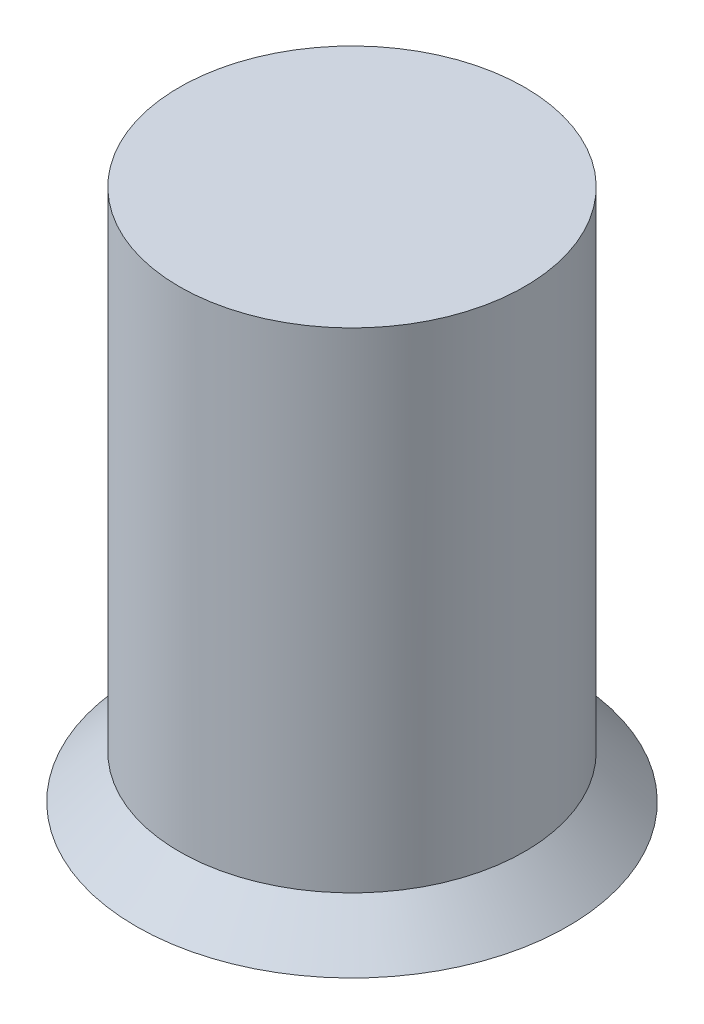
ISO-10303-21;
HEADER;
FILE_DESCRIPTION(('STEP AP214'),'2;1');
FILE_NAME('part.step','',(''),(''),'','','');
FILE_SCHEMA(('AUTOMOTIVE_DESIGN { 1 0 10303 214 1 1 1 1 }'));
ENDSEC;
DATA;
#1=APPLICATION_CONTEXT('core data for automotive mechanical design processes');
#2=APPLICATION_PROTOCOL_DEFINITION('international standard','automotive_design',2000,#1);
#3=PRODUCT_CONTEXT('',#1,'mechanical');
#4=PRODUCT('Part','Part','',(#3));
#5=PRODUCT_RELATED_PRODUCT_CATEGORY('part','',(#4));
#6=PRODUCT_DEFINITION_FORMATION('','',#4);
#7=PRODUCT_DEFINITION_CONTEXT('part definition',#1,'design');
#8=PRODUCT_DEFINITION('design','',#6,#7);
#9=PRODUCT_DEFINITION_SHAPE('','',#8);
#10=(LENGTH_UNIT() NAMED_UNIT(*) SI_UNIT(.MILLI.,.METRE.));
#11=(NAMED_UNIT(*) PLANE_ANGLE_UNIT() SI_UNIT($,.RADIAN.));
#12=(NAMED_UNIT(*) SI_UNIT($,.STERADIAN.) SOLID_ANGLE_UNIT());
#13=UNCERTAINTY_MEASURE_WITH_UNIT(LENGTH_MEASURE(1.E-05),#10,'distance_accuracy_value','');
#14=(GEOMETRIC_REPRESENTATION_CONTEXT(3) GLOBAL_UNCERTAINTY_ASSIGNED_CONTEXT((#13)) GLOBAL_UNIT_ASSIGNED_CONTEXT((#10,
#11,#12)) REPRESENTATION_CONTEXT('',''));
#15=CARTESIAN_POINT('',(0.,0.,0.));
#16=DIRECTION('',(0.,0.,1.));
#17=DIRECTION('',(1.,0.,0.));
#18=AXIS2_PLACEMENT_3D('',#15,#16,#17);
#19=CARTESIAN_POINT('',(0.,0.,0.));
#20=DIRECTION('',(0.,1.,0.));
#21=DIRECTION('',(0.,0.,1.));
#22=AXIS2_PLACEMENT_3D('',#19,#20,#21);
#23=PLANE('',#22);
#24=CARTESIAN_POINT('',(0.,0.,0.));
#25=DIRECTION('',(0.,1.,0.));
#26=DIRECTION('',(0.,0.,1.));
#27=AXIS2_PLACEMENT_3D('',#24,#25,#26);
#28=CIRCLE('',#27,15.);
#29=CARTESIAN_POINT('',(0.,0.,-15.));
#30=VERTEX_POINT('',#29);
#31=EDGE_CURVE('E38',#30,#30,#28,.T.);
#32=ORIENTED_EDGE('',*,*,#31,.F.);
#33=EDGE_LOOP('',(#32));
#34=FACE_BOUND('',#33,.T.);
#35=ADVANCED_FACE('F31',(#34),#23,.F.);
#36=CARTESIAN_POINT('',(0.,3.,0.));
#37=DIRECTION('',(0.,-1.,0.));
#38=DIRECTION('',(0.,0.,-1.));
#39=AXIS2_PLACEMENT_3D('',#36,#37,#38);
#40=CONICAL_SURFACE('',#39,12.,0.785398163397448);
#41=CARTESIAN_POINT('',(0.,3.,0.));
#42=DIRECTION('',(0.,1.,0.));
#43=DIRECTION('',(0.,0.,1.));
#44=AXIS2_PLACEMENT_3D('',#41,#42,#43);
#45=CIRCLE('',#44,12.);
#46=CARTESIAN_POINT('',(0.,3.,-12.));
#47=VERTEX_POINT('',#46);
#48=EDGE_CURVE('E10',#47,#47,#45,.T.);
#49=CARTESIAN_POINT('',(0.,0.,-15.));
#50=CARTESIAN_POINT('',(0.,0.0312499999999996,-14.96875));
#51=CARTESIAN_POINT('',(0.,0.0624999999999996,-14.9375));
#52=CARTESIAN_POINT('',(0.,0.125,-14.875));
#53=CARTESIAN_POINT('',(0.,0.15625,-14.84375));
#54=CARTESIAN_POINT('',(0.,0.21875,-14.78125));
#55=CARTESIAN_POINT('',(0.,0.25,-14.75));
#56=CARTESIAN_POINT('',(0.,0.3125,-14.6875));
#57=CARTESIAN_POINT('',(0.,0.34375,-14.65625));
#58=CARTESIAN_POINT('',(0.,0.40625,-14.59375));
#59=CARTESIAN_POINT('',(0.,0.4375,-14.5625));
#60=CARTESIAN_POINT('',(0.,0.5,-14.5));
#61=CARTESIAN_POINT('',(0.,0.53125,-14.46875));
#62=CARTESIAN_POINT('',(0.,0.59375,-14.40625));
#63=CARTESIAN_POINT('',(0.,0.625,-14.375));
#64=CARTESIAN_POINT('',(0.,0.6875,-14.3125));
#65=CARTESIAN_POINT('',(0.,0.71875,-14.28125));
#66=CARTESIAN_POINT('',(0.,0.78125,-14.21875));
#67=CARTESIAN_POINT('',(0.,0.8125,-14.1875));
#68=CARTESIAN_POINT('',(0.,0.874999999999999,-14.125));
#69=CARTESIAN_POINT('',(0.,0.90625,-14.09375));
#70=CARTESIAN_POINT('',(0.,0.96875,-14.03125));
#71=CARTESIAN_POINT('',(0.,1.,-14.));
#72=CARTESIAN_POINT('',(0.,1.0625,-13.9375));
#73=CARTESIAN_POINT('',(0.,1.09375,-13.90625));
#74=CARTESIAN_POINT('',(0.,1.15625,-13.84375));
#75=CARTESIAN_POINT('',(0.,1.1875,-13.8125));
#76=CARTESIAN_POINT('',(0.,1.25,-13.75));
#77=CARTESIAN_POINT('',(0.,1.28125,-13.71875));
#78=CARTESIAN_POINT('',(0.,1.34375,-13.65625));
#79=CARTESIAN_POINT('',(0.,1.375,-13.625));
#80=CARTESIAN_POINT('',(0.,1.4375,-13.5625));
#81=CARTESIAN_POINT('',(0.,1.46875,-13.53125));
#82=CARTESIAN_POINT('',(0.,1.53125,-13.46875));
#83=CARTESIAN_POINT('',(0.,1.5625,-13.4375));
#84=CARTESIAN_POINT('',(0.,1.625,-13.375));
#85=CARTESIAN_POINT('',(0.,1.65625,-13.34375));
#86=CARTESIAN_POINT('',(0.,1.71875,-13.28125));
#87=CARTESIAN_POINT('',(0.,1.75,-13.25));
#88=CARTESIAN_POINT('',(0.,1.8125,-13.1875));
#89=CARTESIAN_POINT('',(0.,1.84375,-13.15625));
#90=CARTESIAN_POINT('',(0.,1.90625,-13.09375));
#91=CARTESIAN_POINT('',(0.,1.9375,-13.0625));
#92=CARTESIAN_POINT('',(0.,2.,-13.));
#93=CARTESIAN_POINT('',(0.,2.03125,-12.96875));
#94=CARTESIAN_POINT('',(0.,2.09375,-12.90625));
#95=CARTESIAN_POINT('',(0.,2.125,-12.875));
#96=CARTESIAN_POINT('',(0.,2.1875,-12.8125));
#97=CARTESIAN_POINT('',(0.,2.21875,-12.78125));
#98=CARTESIAN_POINT('',(0.,2.28125,-12.71875));
#99=CARTESIAN_POINT('',(0.,2.3125,-12.6875));
#100=CARTESIAN_POINT('',(0.,2.375,-12.625));
#101=CARTESIAN_POINT('',(0.,2.40625,-12.59375));
#102=CARTESIAN_POINT('',(0.,2.46875,-12.53125));
#103=CARTESIAN_POINT('',(0.,2.5,-12.5));
#104=CARTESIAN_POINT('',(0.,2.5625,-12.4375));
#105=CARTESIAN_POINT('',(0.,2.59375,-12.40625));
#106=CARTESIAN_POINT('',(0.,2.65625,-12.34375));
#107=CARTESIAN_POINT('',(0.,2.6875,-12.3125));
#108=CARTESIAN_POINT('',(0.,2.75,-12.25));
#109=CARTESIAN_POINT('',(0.,2.78125,-12.21875));
#110=CARTESIAN_POINT('',(0.,2.84375,-12.15625));
#111=CARTESIAN_POINT('',(0.,2.875,-12.125));
#112=CARTESIAN_POINT('',(0.,2.9375,-12.0625));
#113=CARTESIAN_POINT('',(0.,2.96875,-12.03125));
#114=CARTESIAN_POINT('',(0.,3.,-12.));
#115=B_SPLINE_CURVE_WITH_KNOTS('',3,(#49,#50,#51,#52,#53,#54,#55,#56,#57,#58,#59,#60,#61,#62,
#63,#64,#65,#66,#67,#68,#69,#70,#71,#72,#73,#74,#75,#76,#77,#78,#79,#80,#81,#82,#83,#84,#85,#86,
#87,#88,#89,#90,#91,#92,#93,#94,#95,#96,#97,#98,#99,#100,#101,#102,#103,#104,#105,#106,#107,
#108,#109,#110,#111,#112,#113,#114),.UNSPECIFIED.,.F.,.F.,(4,2,2,2,2,2,2,2,2,2,2,2,2,2,2,2,2,2,
2,2,2,2,2,2,2,2,2,2,2,2,2,2,4),(0.,0.132582521472478,0.265165042944956,0.397747564417433,
0.53033008588991,0.662912607362387,0.795495128834865,0.928077650307343,1.06066017177982,
1.1932426932523,1.32582521472478,1.45840773619725,1.59099025766973,1.72357277914221,
1.85615530061469,1.98873782208716,2.12132034355964,2.25390286503212,2.3864853865046,
2.51906790797708,2.65165042944955,2.78423295092203,2.91681547239451,3.04939799386699,
3.18198051533946,3.31456303681194,3.44714555828442,3.5797280797569,3.71231060122937,
3.84489312270185,3.97747564417433,4.11005816564681,4.24264068711928),.UNSPECIFIED.);
#116=EDGE_CURVE('BSEAM33',#30,#47,#115,.T.);
#117=ORIENTED_EDGE('',*,*,#31,.T.);
#118=ORIENTED_EDGE('',*,*,#48,.F.);
#119=ORIENTED_EDGE('',*,*,#116,.T.);
#120=ORIENTED_EDGE('',*,*,#116,.F.);
#121=EDGE_LOOP('',(#117,#119,#118,#120));
#122=FACE_BOUND('',#121,.T.);
#123=ADVANCED_FACE('F33',(#122),#40,.T.);
#124=CARTESIAN_POINT('',(0.,37.,0.));
#125=DIRECTION('',(0.,-1.,0.));
#126=DIRECTION('',(0.,0.,-1.));
#127=AXIS2_PLACEMENT_3D('',#124,#125,#126);
#128=CYLINDRICAL_SURFACE('',#127,12.);
#129=CARTESIAN_POINT('',(0.,37.,0.));
#130=DIRECTION('',(0.,1.,0.));
#131=DIRECTION('',(0.,0.,1.));
#132=AXIS2_PLACEMENT_3D('',#129,#130,#131);
#133=CIRCLE('',#132,12.);
#134=CARTESIAN_POINT('',(0.,37.,12.));
#135=VERTEX_POINT('',#134);
#136=EDGE_CURVE('E42',#135,#135,#133,.T.);
#137=ORIENTED_EDGE('',*,*,#136,.F.);
#138=EDGE_LOOP('',(#137));
#139=FACE_BOUND('',#138,.T.);
#140=ORIENTED_EDGE('',*,*,#48,.T.);
#141=EDGE_LOOP('',(#140));
#142=FACE_BOUND('',#141,.T.);
#143=ADVANCED_FACE('F51',(#139,#142),#128,.T.);
#144=CARTESIAN_POINT('',(0.,37.,0.));
#145=DIRECTION('',(0.,1.,0.));
#146=DIRECTION('',(0.,0.,1.));
#147=AXIS2_PLACEMENT_3D('',#144,#145,#146);
#148=PLANE('',#147);
#149=ORIENTED_EDGE('',*,*,#136,.T.);
#150=EDGE_LOOP('',(#149));
#151=FACE_BOUND('',#150,.T.);
#152=ADVANCED_FACE('F49',(#151),#148,.T.);
#153=CLOSED_SHELL('',(#35,#123,#143,#152));
#154=MANIFOLD_SOLID_BREP('B2',#153);
#155=ADVANCED_BREP_SHAPE_REPRESENTATION('',(#18,#154),#14);
#156=SHAPE_DEFINITION_REPRESENTATION(#9,#155);
ENDSEC;
END-ISO-10303-21;
